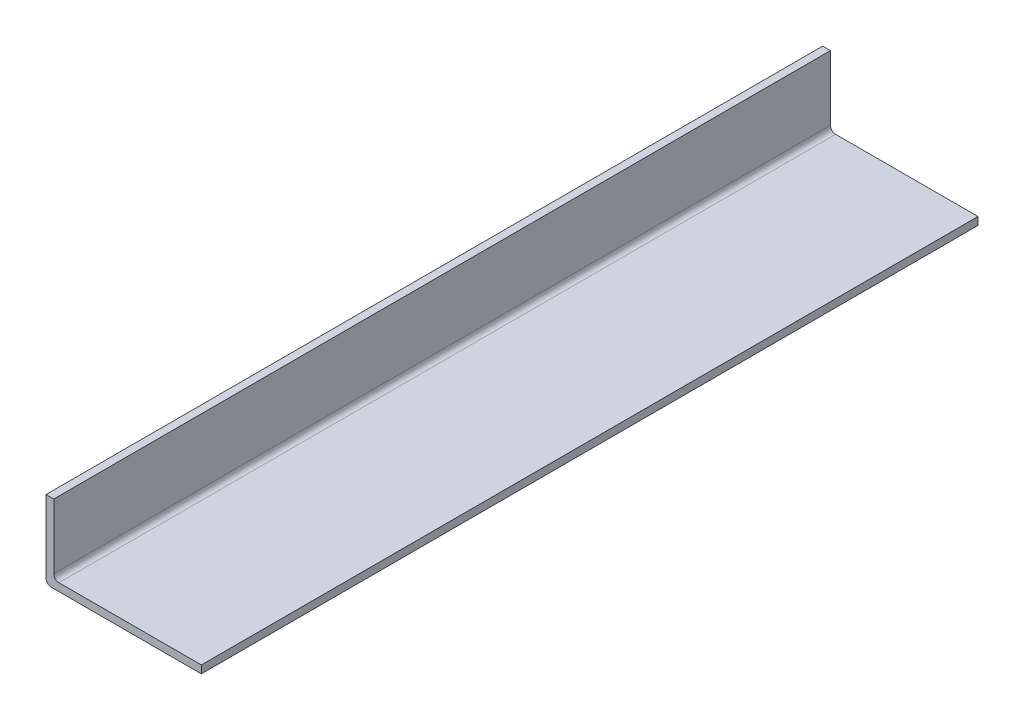
ISO-10303-21;
HEADER;
FILE_DESCRIPTION(('STEP AP214'),'2;1');
FILE_NAME('part.step','',(''),(''),'','','');
FILE_SCHEMA(('AUTOMOTIVE_DESIGN { 1 0 10303 214 1 1 1 1 }'));
ENDSEC;
DATA;
#1=APPLICATION_CONTEXT('core data for automotive mechanical design processes');
#2=APPLICATION_PROTOCOL_DEFINITION('international standard','automotive_design',2000,#1);
#3=PRODUCT_CONTEXT('',#1,'mechanical');
#4=PRODUCT('Part','Part','',(#3));
#5=PRODUCT_RELATED_PRODUCT_CATEGORY('part','',(#4));
#6=PRODUCT_DEFINITION_FORMATION('','',#4);
#7=PRODUCT_DEFINITION_CONTEXT('part definition',#1,'design');
#8=PRODUCT_DEFINITION('design','',#6,#7);
#9=PRODUCT_DEFINITION_SHAPE('','',#8);
#10=(LENGTH_UNIT() NAMED_UNIT(*) SI_UNIT(.MILLI.,.METRE.));
#11=(NAMED_UNIT(*) PLANE_ANGLE_UNIT() SI_UNIT($,.RADIAN.));
#12=(NAMED_UNIT(*) SI_UNIT($,.STERADIAN.) SOLID_ANGLE_UNIT());
#13=UNCERTAINTY_MEASURE_WITH_UNIT(LENGTH_MEASURE(1.E-05),#10,'distance_accuracy_value','');
#14=(GEOMETRIC_REPRESENTATION_CONTEXT(3) GLOBAL_UNCERTAINTY_ASSIGNED_CONTEXT((#13)) GLOBAL_UNIT_ASSIGNED_CONTEXT((#10,
#11,#12)) REPRESENTATION_CONTEXT('',''));
#15=CARTESIAN_POINT('',(0.,0.,0.));
#16=DIRECTION('',(0.,0.,1.));
#17=DIRECTION('',(1.,0.,0.));
#18=AXIS2_PLACEMENT_3D('',#15,#16,#17);
#19=CARTESIAN_POINT('',(3.,30.,300.));
#20=DIRECTION('',(0.,-1.,0.));
#21=DIRECTION('',(0.,0.,-1.));
#22=AXIS2_PLACEMENT_3D('',#19,#20,#21);
#23=PLANE('',#22);
#24=DIRECTION('',(-1.,0.,0.));
#25=VECTOR('',#24,1.);
#26=CARTESIAN_POINT('',(3.,30.,0.));
#27=LINE('',#26,#25);
#28=CARTESIAN_POINT('',(3.,30.,0.));
#29=VERTEX_POINT('',#28);
#30=CARTESIAN_POINT('',(0.,30.,0.));
#31=VERTEX_POINT('',#30);
#32=EDGE_CURVE('E129',#29,#31,#27,.T.);
#33=ORIENTED_EDGE('',*,*,#32,.T.);
#34=DIRECTION('',(0.,0.,-1.));
#35=VECTOR('',#34,1.);
#36=CARTESIAN_POINT('',(0.,30.,300.));
#37=LINE('',#36,#35);
#38=CARTESIAN_POINT('',(0.,30.,300.));
#39=VERTEX_POINT('',#38);
#40=EDGE_CURVE('E110',#39,#31,#37,.T.);
#41=ORIENTED_EDGE('',*,*,#40,.F.);
#42=DIRECTION('',(-1.,0.,0.));
#43=VECTOR('',#42,1.);
#44=CARTESIAN_POINT('',(3.,30.,300.));
#45=LINE('',#44,#43);
#46=CARTESIAN_POINT('',(3.,30.,300.));
#47=VERTEX_POINT('',#46);
#48=EDGE_CURVE('E117',#47,#39,#45,.T.);
#49=ORIENTED_EDGE('',*,*,#48,.F.);
#50=DIRECTION('',(0.,0.,-1.));
#51=VECTOR('',#50,1.);
#52=CARTESIAN_POINT('',(3.,30.,300.));
#53=LINE('',#52,#51);
#54=EDGE_CURVE('E174',#47,#29,#53,.T.);
#55=ORIENTED_EDGE('',*,*,#54,.T.);
#56=EDGE_LOOP('',(#33,#41,#49,#55));
#57=FACE_BOUND('',#56,.T.);
#58=ADVANCED_FACE('F39',(#57),#23,.F.);
#59=CARTESIAN_POINT('',(0.,30.,300.));
#60=DIRECTION('',(1.,0.,0.));
#61=DIRECTION('',(0.,1.,0.));
#62=AXIS2_PLACEMENT_3D('',#59,#60,#61);
#63=PLANE('',#62);
#64=DIRECTION('',(0.,-1.,0.));
#65=VECTOR('',#64,1.);
#66=CARTESIAN_POINT('',(0.,30.,0.));
#67=LINE('',#66,#65);
#68=CARTESIAN_POINT('',(0.,2.,0.));
#69=VERTEX_POINT('',#68);
#70=EDGE_CURVE('E187',#31,#69,#67,.T.);
#71=ORIENTED_EDGE('',*,*,#70,.T.);
#72=DIRECTION('',(0.,0.,-1.));
#73=VECTOR('',#72,1.);
#74=CARTESIAN_POINT('',(0.,2.,300.));
#75=LINE('',#74,#73);
#76=CARTESIAN_POINT('',(0.,2.,300.));
#77=VERTEX_POINT('',#76);
#78=EDGE_CURVE('E113',#69,#77,#75,.F.);
#79=ORIENTED_EDGE('',*,*,#78,.T.);
#80=DIRECTION('',(0.,-1.,0.));
#81=VECTOR('',#80,1.);
#82=CARTESIAN_POINT('',(0.,30.,300.));
#83=LINE('',#82,#81);
#84=EDGE_CURVE('E105',#39,#77,#83,.T.);
#85=ORIENTED_EDGE('',*,*,#84,.F.);
#86=ORIENTED_EDGE('',*,*,#40,.T.);
#87=EDGE_LOOP('',(#71,#79,#85,#86));
#88=FACE_BOUND('',#87,.T.);
#89=ADVANCED_FACE('F108',(#88),#63,.F.);
#90=CARTESIAN_POINT('',(0.,0.,300.));
#91=DIRECTION('',(0.,1.,0.));
#92=DIRECTION('',(0.,0.,1.));
#93=AXIS2_PLACEMENT_3D('',#90,#91,#92);
#94=PLANE('',#93);
#95=DIRECTION('',(1.,0.,0.));
#96=VECTOR('',#95,1.);
#97=CARTESIAN_POINT('',(0.,0.,300.));
#98=LINE('',#97,#96);
#99=CARTESIAN_POINT('',(2.,0.,300.));
#100=VERTEX_POINT('',#99);
#101=CARTESIAN_POINT('',(60.,0.,300.));
#102=VERTEX_POINT('',#101);
#103=EDGE_CURVE('E116',#100,#102,#98,.T.);
#104=ORIENTED_EDGE('',*,*,#103,.F.);
#105=DIRECTION('',(0.,0.,-1.));
#106=VECTOR('',#105,1.);
#107=CARTESIAN_POINT('',(2.,0.,300.));
#108=LINE('',#107,#106);
#109=CARTESIAN_POINT('',(2.,0.,0.));
#110=VERTEX_POINT('',#109);
#111=EDGE_CURVE('E131',#100,#110,#108,.T.);
#112=ORIENTED_EDGE('',*,*,#111,.T.);
#113=DIRECTION('',(1.,0.,0.));
#114=VECTOR('',#113,1.);
#115=CARTESIAN_POINT('',(0.,0.,0.));
#116=LINE('',#115,#114);
#117=CARTESIAN_POINT('',(60.,0.,0.));
#118=VERTEX_POINT('',#117);
#119=EDGE_CURVE('E190',#110,#118,#116,.T.);
#120=ORIENTED_EDGE('',*,*,#119,.T.);
#121=DIRECTION('',(0.,0.,-1.));
#122=VECTOR('',#121,1.);
#123=CARTESIAN_POINT('',(60.,0.,300.));
#124=LINE('',#123,#122);
#125=EDGE_CURVE('E132',#102,#118,#124,.T.);
#126=ORIENTED_EDGE('',*,*,#125,.F.);
#127=EDGE_LOOP('',(#104,#112,#120,#126));
#128=FACE_BOUND('',#127,.T.);
#129=ADVANCED_FACE('F206',(#128),#94,.F.);
#130=CARTESIAN_POINT('',(60.,0.,300.));
#131=DIRECTION('',(-1.,0.,0.));
#132=DIRECTION('',(0.,0.,1.));
#133=AXIS2_PLACEMENT_3D('',#130,#131,#132);
#134=PLANE('',#133);
#135=DIRECTION('',(0.,1.,0.));
#136=VECTOR('',#135,1.);
#137=CARTESIAN_POINT('',(60.,0.,0.));
#138=LINE('',#137,#136);
#139=CARTESIAN_POINT('',(60.,3.,0.));
#140=VERTEX_POINT('',#139);
#141=EDGE_CURVE('E170',#118,#140,#138,.T.);
#142=ORIENTED_EDGE('',*,*,#141,.T.);
#143=DIRECTION('',(0.,0.,-1.));
#144=VECTOR('',#143,1.);
#145=CARTESIAN_POINT('',(60.,3.,300.));
#146=LINE('',#145,#144);
#147=CARTESIAN_POINT('',(60.,3.,300.));
#148=VERTEX_POINT('',#147);
#149=EDGE_CURVE('E140',#148,#140,#146,.T.);
#150=ORIENTED_EDGE('',*,*,#149,.F.);
#151=DIRECTION('',(0.,1.,0.));
#152=VECTOR('',#151,1.);
#153=CARTESIAN_POINT('',(60.,0.,300.));
#154=LINE('',#153,#152);
#155=EDGE_CURVE('E181',#102,#148,#154,.T.);
#156=ORIENTED_EDGE('',*,*,#155,.F.);
#157=ORIENTED_EDGE('',*,*,#125,.T.);
#158=EDGE_LOOP('',(#142,#150,#156,#157));
#159=FACE_BOUND('',#158,.T.);
#160=ADVANCED_FACE('F204',(#159),#134,.F.);
#161=CARTESIAN_POINT('',(60.,3.,300.));
#162=DIRECTION('',(0.,-1.,0.));
#163=DIRECTION('',(1.,0.,0.));
#164=AXIS2_PLACEMENT_3D('',#161,#162,#163);
#165=PLANE('',#164);
#166=DIRECTION('',(-1.,0.,0.));
#167=VECTOR('',#166,1.);
#168=CARTESIAN_POINT('',(60.,3.,0.));
#169=LINE('',#168,#167);
#170=CARTESIAN_POINT('',(5.,3.,0.));
#171=VERTEX_POINT('',#170);
#172=EDGE_CURVE('E163',#140,#171,#169,.T.);
#173=ORIENTED_EDGE('',*,*,#172,.T.);
#174=DIRECTION('',(0.,0.,-1.));
#175=VECTOR('',#174,1.);
#176=CARTESIAN_POINT('',(5.,3.,300.));
#177=LINE('',#176,#175);
#178=CARTESIAN_POINT('',(5.,3.,300.));
#179=VERTEX_POINT('',#178);
#180=EDGE_CURVE('E61',#171,#179,#177,.F.);
#181=ORIENTED_EDGE('',*,*,#180,.T.);
#182=DIRECTION('',(-1.,0.,0.));
#183=VECTOR('',#182,1.);
#184=CARTESIAN_POINT('',(60.,3.,300.));
#185=LINE('',#184,#183);
#186=EDGE_CURVE('E176',#148,#179,#185,.T.);
#187=ORIENTED_EDGE('',*,*,#186,.F.);
#188=ORIENTED_EDGE('',*,*,#149,.T.);
#189=EDGE_LOOP('',(#173,#181,#187,#188));
#190=FACE_BOUND('',#189,.T.);
#191=ADVANCED_FACE('F167',(#190),#165,.F.);
#192=CARTESIAN_POINT('',(3.,3.,300.));
#193=DIRECTION('',(-1.,0.,0.));
#194=DIRECTION('',(0.,-1.,0.));
#195=AXIS2_PLACEMENT_3D('',#192,#193,#194);
#196=PLANE('',#195);
#197=DIRECTION('',(0.,1.,0.));
#198=VECTOR('',#197,1.);
#199=CARTESIAN_POINT('',(3.,3.,300.));
#200=LINE('',#199,#198);
#201=CARTESIAN_POINT('',(3.,5.,300.));
#202=VERTEX_POINT('',#201);
#203=EDGE_CURVE('E121',#202,#47,#200,.T.);
#204=ORIENTED_EDGE('',*,*,#203,.F.);
#205=DIRECTION('',(0.,0.,-1.));
#206=VECTOR('',#205,1.);
#207=CARTESIAN_POINT('',(3.,5.,0.));
#208=LINE('',#207,#206);
#209=CARTESIAN_POINT('',(3.,5.,0.));
#210=VERTEX_POINT('',#209);
#211=EDGE_CURVE('E151',#202,#210,#208,.T.);
#212=ORIENTED_EDGE('',*,*,#211,.T.);
#213=DIRECTION('',(0.,1.,0.));
#214=VECTOR('',#213,1.);
#215=CARTESIAN_POINT('',(3.,3.,0.));
#216=LINE('',#215,#214);
#217=EDGE_CURVE('E126',#210,#29,#216,.T.);
#218=ORIENTED_EDGE('',*,*,#217,.T.);
#219=ORIENTED_EDGE('',*,*,#54,.F.);
#220=EDGE_LOOP('',(#204,#212,#218,#219));
#221=FACE_BOUND('',#220,.T.);
#222=ADVANCED_FACE('F173',(#221),#196,.F.);
#223=CARTESIAN_POINT('',(0.,0.,300.));
#224=DIRECTION('',(0.,0.,1.));
#225=DIRECTION('',(1.,0.,0.));
#226=AXIS2_PLACEMENT_3D('',#223,#224,#225);
#227=PLANE('',#226);
#228=ORIENTED_EDGE('',*,*,#84,.T.);
#229=CARTESIAN_POINT('',(2.,2.,300.));
#230=DIRECTION('',(0.,0.,1.));
#231=DIRECTION('',(1.,0.,0.));
#232=AXIS2_PLACEMENT_3D('',#229,#230,#231);
#233=CIRCLE('',#232,2.);
#234=EDGE_CURVE('E148',#77,#100,#233,.T.);
#235=ORIENTED_EDGE('',*,*,#234,.T.);
#236=ORIENTED_EDGE('',*,*,#103,.T.);
#237=ORIENTED_EDGE('',*,*,#155,.T.);
#238=ORIENTED_EDGE('',*,*,#186,.T.);
#239=CARTESIAN_POINT('',(5.,5.,300.));
#240=DIRECTION('',(0.,0.,1.));
#241=DIRECTION('',(1.,0.,0.));
#242=AXIS2_PLACEMENT_3D('',#239,#240,#241);
#243=CIRCLE('',#242,2.);
#244=EDGE_CURVE('E11',#179,#202,#243,.F.);
#245=ORIENTED_EDGE('',*,*,#244,.T.);
#246=ORIENTED_EDGE('',*,*,#203,.T.);
#247=ORIENTED_EDGE('',*,*,#48,.T.);
#248=EDGE_LOOP('',(#228,#235,#236,#237,#238,#245,#246,#247));
#249=FACE_BOUND('',#248,.T.);
#250=ADVANCED_FACE('F120',(#249),#227,.T.);
#251=CARTESIAN_POINT('',(0.,0.,0.));
#252=DIRECTION('',(0.,0.,1.));
#253=DIRECTION('',(1.,0.,0.));
#254=AXIS2_PLACEMENT_3D('',#251,#252,#253);
#255=PLANE('',#254);
#256=ORIENTED_EDGE('',*,*,#119,.F.);
#257=CARTESIAN_POINT('',(2.,2.,0.));
#258=DIRECTION('',(0.,0.,1.));
#259=DIRECTION('',(1.,0.,0.));
#260=AXIS2_PLACEMENT_3D('',#257,#258,#259);
#261=CIRCLE('',#260,2.);
#262=EDGE_CURVE('E137',#110,#69,#261,.F.);
#263=ORIENTED_EDGE('',*,*,#262,.T.);
#264=ORIENTED_EDGE('',*,*,#70,.F.);
#265=ORIENTED_EDGE('',*,*,#32,.F.);
#266=ORIENTED_EDGE('',*,*,#217,.F.);
#267=CARTESIAN_POINT('',(5.,5.,0.));
#268=DIRECTION('',(0.,0.,1.));
#269=DIRECTION('',(1.,0.,0.));
#270=AXIS2_PLACEMENT_3D('',#267,#268,#269);
#271=CIRCLE('',#270,2.);
#272=EDGE_CURVE('E48',#210,#171,#271,.T.);
#273=ORIENTED_EDGE('',*,*,#272,.T.);
#274=ORIENTED_EDGE('',*,*,#172,.F.);
#275=ORIENTED_EDGE('',*,*,#141,.F.);
#276=EDGE_LOOP('',(#256,#263,#264,#265,#266,#273,#274,#275));
#277=FACE_BOUND('',#276,.T.);
#278=ADVANCED_FACE('F161',(#277),#255,.F.);
#279=CARTESIAN_POINT('',(2.,2.,300.));
#280=DIRECTION('',(0.,0.,-1.));
#281=DIRECTION('',(-1.,0.,0.));
#282=AXIS2_PLACEMENT_3D('',#279,#280,#281);
#283=CYLINDRICAL_SURFACE('',#282,2.);
#284=ORIENTED_EDGE('',*,*,#234,.F.);
#285=ORIENTED_EDGE('',*,*,#78,.F.);
#286=ORIENTED_EDGE('',*,*,#262,.F.);
#287=ORIENTED_EDGE('',*,*,#111,.F.);
#288=EDGE_LOOP('',(#284,#285,#286,#287));
#289=FACE_BOUND('',#288,.T.);
#290=ADVANCED_FACE('F209',(#289),#283,.T.);
#291=CARTESIAN_POINT('',(5.,5.,300.));
#292=DIRECTION('',(0.,0.,1.));
#293=DIRECTION('',(1.,0.,0.));
#294=AXIS2_PLACEMENT_3D('',#291,#292,#293);
#295=CYLINDRICAL_SURFACE('',#294,2.);
#296=ORIENTED_EDGE('',*,*,#244,.F.);
#297=ORIENTED_EDGE('',*,*,#180,.F.);
#298=ORIENTED_EDGE('',*,*,#272,.F.);
#299=ORIENTED_EDGE('',*,*,#211,.F.);
#300=EDGE_LOOP('',(#296,#297,#298,#299));
#301=FACE_BOUND('',#300,.T.);
#302=ADVANCED_FACE('F41',(#301),#295,.F.);
#303=CLOSED_SHELL('',(#58,#89,#129,#160,#191,#222,#250,#278,#290,#302));
#304=MANIFOLD_SOLID_BREP('B2',#303);
#305=ADVANCED_BREP_SHAPE_REPRESENTATION('',(#18,#304),#14);
#306=SHAPE_DEFINITION_REPRESENTATION(#9,#305);
ENDSEC;
END-ISO-10303-21;
